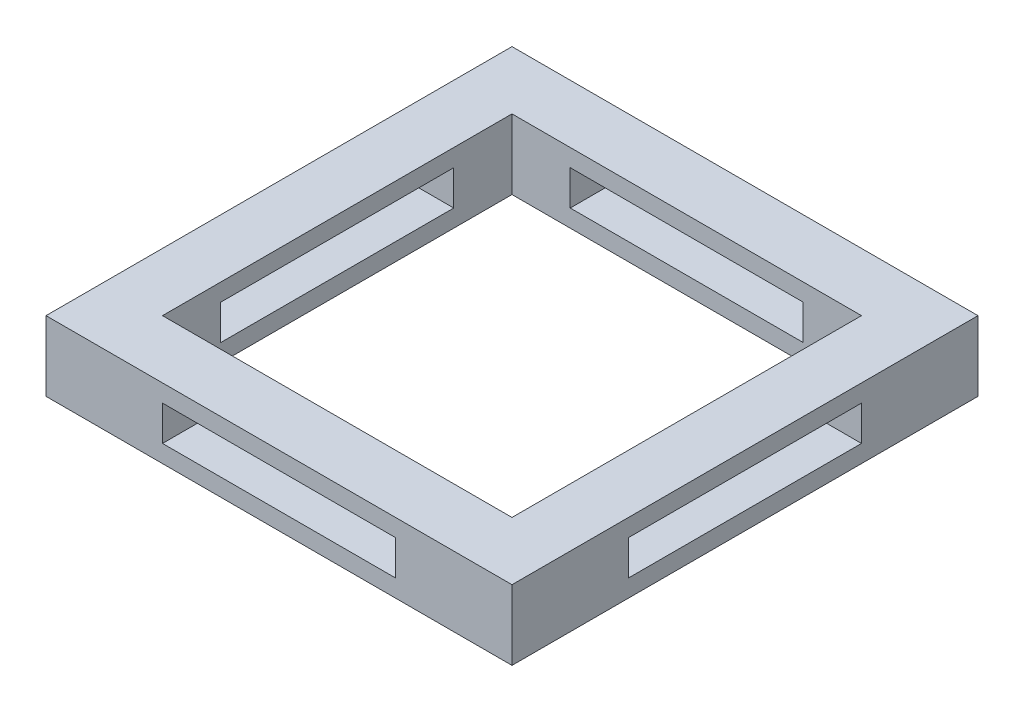
ISO-10303-21;
HEADER;
FILE_DESCRIPTION(('STEP AP214'),'2;1');
FILE_NAME('part.step','',(''),(''),'','','');
FILE_SCHEMA(('AUTOMOTIVE_DESIGN { 1 0 10303 214 1 1 1 1 }'));
ENDSEC;
DATA;
#1=APPLICATION_CONTEXT('core data for automotive mechanical design processes');
#2=APPLICATION_PROTOCOL_DEFINITION('international standard','automotive_design',2000,#1);
#3=PRODUCT_CONTEXT('',#1,'mechanical');
#4=PRODUCT('Part','Part','',(#3));
#5=PRODUCT_RELATED_PRODUCT_CATEGORY('part','',(#4));
#6=PRODUCT_DEFINITION_FORMATION('','',#4);
#7=PRODUCT_DEFINITION_CONTEXT('part definition',#1,'design');
#8=PRODUCT_DEFINITION('design','',#6,#7);
#9=PRODUCT_DEFINITION_SHAPE('','',#8);
#10=(LENGTH_UNIT() NAMED_UNIT(*) SI_UNIT(.MILLI.,.METRE.));
#11=(NAMED_UNIT(*) PLANE_ANGLE_UNIT() SI_UNIT($,.RADIAN.));
#12=(NAMED_UNIT(*) SI_UNIT($,.STERADIAN.) SOLID_ANGLE_UNIT());
#13=UNCERTAINTY_MEASURE_WITH_UNIT(LENGTH_MEASURE(1.E-05),#10,'distance_accuracy_value','');
#14=(GEOMETRIC_REPRESENTATION_CONTEXT(3) GLOBAL_UNCERTAINTY_ASSIGNED_CONTEXT((#13)) GLOBAL_UNIT_ASSIGNED_CONTEXT((#10,
#11,#12)) REPRESENTATION_CONTEXT('',''));
#15=CARTESIAN_POINT('',(0.,0.,0.));
#16=DIRECTION('',(0.,0.,1.));
#17=DIRECTION('',(1.,0.,0.));
#18=AXIS2_PLACEMENT_3D('',#15,#16,#17);
#19=CARTESIAN_POINT('',(0.,3.,0.));
#20=DIRECTION('',(0.,1.,0.));
#21=DIRECTION('',(0.,0.,1.));
#22=AXIS2_PLACEMENT_3D('',#19,#20,#21);
#23=PLANE('',#22);
#24=DIRECTION('',(0.,0.,1.));
#25=VECTOR('',#24,1.);
#26=CARTESIAN_POINT('',(-10.,3.,10.));
#27=LINE('',#26,#25);
#28=CARTESIAN_POINT('',(-10.,3.,-10.));
#29=VERTEX_POINT('',#28);
#30=CARTESIAN_POINT('',(-10.,3.,10.));
#31=VERTEX_POINT('',#30);
#32=EDGE_CURVE('E379',#29,#31,#27,.T.);
#33=ORIENTED_EDGE('',*,*,#32,.T.);
#34=DIRECTION('',(1.,0.,0.));
#35=VECTOR('',#34,1.);
#36=CARTESIAN_POINT('',(10.,3.,10.));
#37=LINE('',#36,#35);
#38=CARTESIAN_POINT('',(10.,3.,10.));
#39=VERTEX_POINT('',#38);
#40=EDGE_CURVE('E383',#31,#39,#37,.T.);
#41=ORIENTED_EDGE('',*,*,#40,.T.);
#42=DIRECTION('',(0.,0.,-1.));
#43=VECTOR('',#42,1.);
#44=CARTESIAN_POINT('',(10.,3.,10.));
#45=LINE('',#44,#43);
#46=CARTESIAN_POINT('',(10.,3.,-10.));
#47=VERTEX_POINT('',#46);
#48=EDGE_CURVE('E387',#39,#47,#45,.T.);
#49=ORIENTED_EDGE('',*,*,#48,.T.);
#50=DIRECTION('',(-1.,0.,0.));
#51=VECTOR('',#50,1.);
#52=CARTESIAN_POINT('',(10.,3.,-10.));
#53=LINE('',#52,#51);
#54=EDGE_CURVE('E390',#47,#29,#53,.T.);
#55=ORIENTED_EDGE('',*,*,#54,.T.);
#56=EDGE_LOOP('',(#33,#41,#49,#55));
#57=FACE_BOUND('',#56,.T.);
#58=DIRECTION('',(1.,0.,0.));
#59=VECTOR('',#58,1.);
#60=CARTESIAN_POINT('',(7.5,3.,7.5));
#61=LINE('',#60,#59);
#62=CARTESIAN_POINT('',(-7.5,3.,7.5));
#63=VERTEX_POINT('',#62);
#64=CARTESIAN_POINT('',(7.5,3.,7.5));
#65=VERTEX_POINT('',#64);
#66=EDGE_CURVE('E339',#63,#65,#61,.T.);
#67=ORIENTED_EDGE('',*,*,#66,.F.);
#68=DIRECTION('',(0.,0.,1.));
#69=VECTOR('',#68,1.);
#70=CARTESIAN_POINT('',(-7.5,3.,7.5));
#71=LINE('',#70,#69);
#72=CARTESIAN_POINT('',(-7.5,3.,-7.5));
#73=VERTEX_POINT('',#72);
#74=EDGE_CURVE('E336',#73,#63,#71,.T.);
#75=ORIENTED_EDGE('',*,*,#74,.F.);
#76=DIRECTION('',(-1.,0.,0.));
#77=VECTOR('',#76,1.);
#78=CARTESIAN_POINT('',(7.5,3.,-7.5));
#79=LINE('',#78,#77);
#80=CARTESIAN_POINT('',(7.5,3.,-7.5));
#81=VERTEX_POINT('',#80);
#82=EDGE_CURVE('E347',#81,#73,#79,.T.);
#83=ORIENTED_EDGE('',*,*,#82,.F.);
#84=DIRECTION('',(0.,0.,-1.));
#85=VECTOR('',#84,1.);
#86=CARTESIAN_POINT('',(7.5,3.,7.5));
#87=LINE('',#86,#85);
#88=EDGE_CURVE('E343',#65,#81,#87,.T.);
#89=ORIENTED_EDGE('',*,*,#88,.F.);
#90=EDGE_LOOP('',(#67,#75,#83,#89));
#91=FACE_BOUND('',#90,.T.);
#92=ADVANCED_FACE('F39',(#57,#91),#23,.T.);
#93=CARTESIAN_POINT('',(0.,0.,0.));
#94=DIRECTION('',(0.,1.,0.));
#95=DIRECTION('',(0.,0.,1.));
#96=AXIS2_PLACEMENT_3D('',#93,#94,#95);
#97=PLANE('',#96);
#98=DIRECTION('',(0.,0.,1.));
#99=VECTOR('',#98,1.);
#100=CARTESIAN_POINT('',(-10.,0.,10.));
#101=LINE('',#100,#99);
#102=CARTESIAN_POINT('',(-10.,0.,-10.));
#103=VERTEX_POINT('',#102);
#104=CARTESIAN_POINT('',(-10.,0.,10.));
#105=VERTEX_POINT('',#104);
#106=EDGE_CURVE('E378',#103,#105,#101,.T.);
#107=ORIENTED_EDGE('',*,*,#106,.F.);
#108=DIRECTION('',(-1.,0.,0.));
#109=VECTOR('',#108,1.);
#110=CARTESIAN_POINT('',(10.,0.,-10.));
#111=LINE('',#110,#109);
#112=CARTESIAN_POINT('',(10.,0.,-10.));
#113=VERTEX_POINT('',#112);
#114=EDGE_CURVE('E384',#113,#103,#111,.T.);
#115=ORIENTED_EDGE('',*,*,#114,.F.);
#116=DIRECTION('',(0.,0.,-1.));
#117=VECTOR('',#116,1.);
#118=CARTESIAN_POINT('',(10.,0.,10.));
#119=LINE('',#118,#117);
#120=CARTESIAN_POINT('',(10.,0.,10.));
#121=VERTEX_POINT('',#120);
#122=EDGE_CURVE('E400',#121,#113,#119,.T.);
#123=ORIENTED_EDGE('',*,*,#122,.F.);
#124=DIRECTION('',(1.,0.,0.));
#125=VECTOR('',#124,1.);
#126=CARTESIAN_POINT('',(10.,0.,10.));
#127=LINE('',#126,#125);
#128=EDGE_CURVE('E397',#105,#121,#127,.T.);
#129=ORIENTED_EDGE('',*,*,#128,.F.);
#130=EDGE_LOOP('',(#107,#115,#123,#129));
#131=FACE_BOUND('',#130,.T.);
#132=DIRECTION('',(0.,0.,1.));
#133=VECTOR('',#132,1.);
#134=CARTESIAN_POINT('',(-7.5,0.,7.5));
#135=LINE('',#134,#133);
#136=CARTESIAN_POINT('',(-7.5,0.,-7.5));
#137=VERTEX_POINT('',#136);
#138=CARTESIAN_POINT('',(-7.5,0.,7.5));
#139=VERTEX_POINT('',#138);
#140=EDGE_CURVE('E335',#137,#139,#135,.T.);
#141=ORIENTED_EDGE('',*,*,#140,.T.);
#142=DIRECTION('',(1.,0.,0.));
#143=VECTOR('',#142,1.);
#144=CARTESIAN_POINT('',(7.5,0.,7.5));
#145=LINE('',#144,#143);
#146=CARTESIAN_POINT('',(7.5,0.,7.5));
#147=VERTEX_POINT('',#146);
#148=EDGE_CURVE('E354',#139,#147,#145,.T.);
#149=ORIENTED_EDGE('',*,*,#148,.T.);
#150=DIRECTION('',(0.,0.,-1.));
#151=VECTOR('',#150,1.);
#152=CARTESIAN_POINT('',(7.5,0.,7.5));
#153=LINE('',#152,#151);
#154=CARTESIAN_POINT('',(7.5,0.,-7.5));
#155=VERTEX_POINT('',#154);
#156=EDGE_CURVE('E358',#147,#155,#153,.T.);
#157=ORIENTED_EDGE('',*,*,#156,.T.);
#158=DIRECTION('',(-1.,0.,0.));
#159=VECTOR('',#158,1.);
#160=CARTESIAN_POINT('',(7.5,0.,-7.5));
#161=LINE('',#160,#159);
#162=EDGE_CURVE('E340',#155,#137,#161,.T.);
#163=ORIENTED_EDGE('',*,*,#162,.T.);
#164=EDGE_LOOP('',(#141,#149,#157,#163));
#165=FACE_BOUND('',#164,.T.);
#166=ADVANCED_FACE('F462',(#131,#165),#97,.F.);
#167=CARTESIAN_POINT('',(-10.,3.,10.));
#168=DIRECTION('',(1.,0.,0.));
#169=DIRECTION('',(0.,0.,-1.));
#170=AXIS2_PLACEMENT_3D('',#167,#168,#169);
#171=PLANE('',#170);
#172=DIRECTION('',(0.,0.,1.));
#173=VECTOR('',#172,1.);
#174=CARTESIAN_POINT('',(-10.,0.75,5.));
#175=LINE('',#174,#173);
#176=CARTESIAN_POINT('',(-10.,0.749999999999998,-5.));
#177=VERTEX_POINT('',#176);
#178=CARTESIAN_POINT('',(-10.,0.75,5.));
#179=VERTEX_POINT('',#178);
#180=EDGE_CURVE('E241',#177,#179,#175,.T.);
#181=ORIENTED_EDGE('',*,*,#180,.F.);
#182=DIRECTION('',(0.,-1.,0.));
#183=VECTOR('',#182,1.);
#184=CARTESIAN_POINT('',(-10.,0.749999999999999,-5.));
#185=LINE('',#184,#183);
#186=CARTESIAN_POINT('',(-10.,2.25,-5.));
#187=VERTEX_POINT('',#186);
#188=EDGE_CURVE('E55',#187,#177,#185,.T.);
#189=ORIENTED_EDGE('',*,*,#188,.F.);
#190=DIRECTION('',(0.,0.,-1.));
#191=VECTOR('',#190,1.);
#192=CARTESIAN_POINT('',(-10.,2.25,5.));
#193=LINE('',#192,#191);
#194=CARTESIAN_POINT('',(-10.,2.25,5.));
#195=VERTEX_POINT('',#194);
#196=EDGE_CURVE('E228',#195,#187,#193,.T.);
#197=ORIENTED_EDGE('',*,*,#196,.F.);
#198=DIRECTION('',(0.,1.,0.));
#199=VECTOR('',#198,1.);
#200=CARTESIAN_POINT('',(-10.,0.75,5.));
#201=LINE('',#200,#199);
#202=EDGE_CURVE('E232',#179,#195,#201,.T.);
#203=ORIENTED_EDGE('',*,*,#202,.F.);
#204=EDGE_LOOP('',(#181,#189,#197,#203));
#205=FACE_BOUND('',#204,.T.);
#206=ORIENTED_EDGE('',*,*,#106,.T.);
#207=DIRECTION('',(0.,-1.,0.));
#208=VECTOR('',#207,1.);
#209=CARTESIAN_POINT('',(-10.,3.,10.));
#210=LINE('',#209,#208);
#211=EDGE_CURVE('E416',#31,#105,#210,.T.);
#212=ORIENTED_EDGE('',*,*,#211,.F.);
#213=ORIENTED_EDGE('',*,*,#32,.F.);
#214=DIRECTION('',(0.,-1.,0.));
#215=VECTOR('',#214,1.);
#216=CARTESIAN_POINT('',(-10.,3.,-10.));
#217=LINE('',#216,#215);
#218=EDGE_CURVE('E393',#29,#103,#217,.T.);
#219=ORIENTED_EDGE('',*,*,#218,.T.);
#220=EDGE_LOOP('',(#206,#212,#213,#219));
#221=FACE_BOUND('',#220,.T.);
#222=ADVANCED_FACE('F41',(#205,#221),#171,.F.);
#223=CARTESIAN_POINT('',(10.,3.,10.));
#224=DIRECTION('',(0.,0.,-1.));
#225=DIRECTION('',(-1.,0.,0.));
#226=AXIS2_PLACEMENT_3D('',#223,#224,#225);
#227=PLANE('',#226);
#228=DIRECTION('',(1.,0.,0.));
#229=VECTOR('',#228,1.);
#230=CARTESIAN_POINT('',(5.,0.750000000000001,10.));
#231=LINE('',#230,#229);
#232=CARTESIAN_POINT('',(-5.,0.749999999999999,10.));
#233=VERTEX_POINT('',#232);
#234=CARTESIAN_POINT('',(5.,0.750000000000001,10.));
#235=VERTEX_POINT('',#234);
#236=EDGE_CURVE('E293',#233,#235,#231,.T.);
#237=ORIENTED_EDGE('',*,*,#236,.F.);
#238=DIRECTION('',(0.,-1.,0.));
#239=VECTOR('',#238,1.);
#240=CARTESIAN_POINT('',(-5.,0.749999999999999,10.));
#241=LINE('',#240,#239);
#242=CARTESIAN_POINT('',(-5.,2.25,10.));
#243=VERTEX_POINT('',#242);
#244=EDGE_CURVE('E272',#243,#233,#241,.T.);
#245=ORIENTED_EDGE('',*,*,#244,.F.);
#246=DIRECTION('',(-1.,0.,0.));
#247=VECTOR('',#246,1.);
#248=CARTESIAN_POINT('',(5.,2.25,10.));
#249=LINE('',#248,#247);
#250=CARTESIAN_POINT('',(5.,2.25,10.));
#251=VERTEX_POINT('',#250);
#252=EDGE_CURVE('E278',#251,#243,#249,.T.);
#253=ORIENTED_EDGE('',*,*,#252,.F.);
#254=DIRECTION('',(0.,1.,0.));
#255=VECTOR('',#254,1.);
#256=CARTESIAN_POINT('',(5.,0.750000000000001,10.));
#257=LINE('',#256,#255);
#258=EDGE_CURVE('E297',#235,#251,#257,.T.);
#259=ORIENTED_EDGE('',*,*,#258,.F.);
#260=EDGE_LOOP('',(#237,#245,#253,#259));
#261=FACE_BOUND('',#260,.T.);
#262=ORIENTED_EDGE('',*,*,#128,.T.);
#263=DIRECTION('',(0.,-1.,0.));
#264=VECTOR('',#263,1.);
#265=CARTESIAN_POINT('',(10.,3.,10.));
#266=LINE('',#265,#264);
#267=EDGE_CURVE('E412',#39,#121,#266,.T.);
#268=ORIENTED_EDGE('',*,*,#267,.F.);
#269=ORIENTED_EDGE('',*,*,#40,.F.);
#270=ORIENTED_EDGE('',*,*,#211,.T.);
#271=EDGE_LOOP('',(#262,#268,#269,#270));
#272=FACE_BOUND('',#271,.T.);
#273=ADVANCED_FACE('F480',(#261,#272),#227,.F.);
#274=CARTESIAN_POINT('',(10.,3.,10.));
#275=DIRECTION('',(-1.,0.,0.));
#276=DIRECTION('',(0.,0.,1.));
#277=AXIS2_PLACEMENT_3D('',#274,#275,#276);
#278=PLANE('',#277);
#279=DIRECTION('',(0.,0.,-1.));
#280=VECTOR('',#279,1.);
#281=CARTESIAN_POINT('',(10.,2.25,5.));
#282=LINE('',#281,#280);
#283=CARTESIAN_POINT('',(10.,2.25,5.));
#284=VERTEX_POINT('',#283);
#285=CARTESIAN_POINT('',(10.,2.25,-5.));
#286=VERTEX_POINT('',#285);
#287=EDGE_CURVE('E226',#284,#286,#282,.T.);
#288=ORIENTED_EDGE('',*,*,#287,.T.);
#289=DIRECTION('',(0.,-1.,0.));
#290=VECTOR('',#289,1.);
#291=CARTESIAN_POINT('',(10.,0.749999999999999,-5.));
#292=LINE('',#291,#290);
#293=CARTESIAN_POINT('',(10.,0.749999999999999,-5.));
#294=VERTEX_POINT('',#293);
#295=EDGE_CURVE('E207',#286,#294,#292,.T.);
#296=ORIENTED_EDGE('',*,*,#295,.T.);
#297=DIRECTION('',(0.,0.,1.));
#298=VECTOR('',#297,1.);
#299=CARTESIAN_POINT('',(10.,0.75,5.));
#300=LINE('',#299,#298);
#301=CARTESIAN_POINT('',(10.,0.75,5.));
#302=VERTEX_POINT('',#301);
#303=EDGE_CURVE('E217',#294,#302,#300,.T.);
#304=ORIENTED_EDGE('',*,*,#303,.T.);
#305=DIRECTION('',(0.,1.,0.));
#306=VECTOR('',#305,1.);
#307=CARTESIAN_POINT('',(10.,0.75,5.));
#308=LINE('',#307,#306);
#309=EDGE_CURVE('E63',#302,#284,#308,.T.);
#310=ORIENTED_EDGE('',*,*,#309,.T.);
#311=EDGE_LOOP('',(#288,#296,#304,#310));
#312=FACE_BOUND('',#311,.T.);
#313=ORIENTED_EDGE('',*,*,#122,.T.);
#314=DIRECTION('',(0.,-1.,0.));
#315=VECTOR('',#314,1.);
#316=CARTESIAN_POINT('',(10.,3.,-10.));
#317=LINE('',#316,#315);
#318=EDGE_CURVE('E408',#47,#113,#317,.T.);
#319=ORIENTED_EDGE('',*,*,#318,.F.);
#320=ORIENTED_EDGE('',*,*,#48,.F.);
#321=ORIENTED_EDGE('',*,*,#267,.T.);
#322=EDGE_LOOP('',(#313,#319,#320,#321));
#323=FACE_BOUND('',#322,.T.);
#324=ADVANCED_FACE('F223',(#312,#323),#278,.F.);
#325=CARTESIAN_POINT('',(10.,3.,-10.));
#326=DIRECTION('',(0.,0.,1.));
#327=DIRECTION('',(1.,0.,0.));
#328=AXIS2_PLACEMENT_3D('',#325,#326,#327);
#329=PLANE('',#328);
#330=DIRECTION('',(-1.,0.,0.));
#331=VECTOR('',#330,1.);
#332=CARTESIAN_POINT('',(5.,2.25,-10.));
#333=LINE('',#332,#331);
#334=CARTESIAN_POINT('',(5.,2.25,-10.));
#335=VERTEX_POINT('',#334);
#336=CARTESIAN_POINT('',(-5.,2.25,-10.));
#337=VERTEX_POINT('',#336);
#338=EDGE_CURVE('E286',#335,#337,#333,.T.);
#339=ORIENTED_EDGE('',*,*,#338,.T.);
#340=DIRECTION('',(0.,-1.,0.));
#341=VECTOR('',#340,1.);
#342=CARTESIAN_POINT('',(-5.,0.749999999999999,-10.));
#343=LINE('',#342,#341);
#344=CARTESIAN_POINT('',(-5.,0.749999999999999,-10.));
#345=VERTEX_POINT('',#344);
#346=EDGE_CURVE('E273',#337,#345,#343,.T.);
#347=ORIENTED_EDGE('',*,*,#346,.T.);
#348=DIRECTION('',(1.,0.,0.));
#349=VECTOR('',#348,1.);
#350=CARTESIAN_POINT('',(5.,0.750000000000001,-10.));
#351=LINE('',#350,#349);
#352=CARTESIAN_POINT('',(5.,0.750000000000001,-10.));
#353=VERTEX_POINT('',#352);
#354=EDGE_CURVE('E277',#345,#353,#351,.T.);
#355=ORIENTED_EDGE('',*,*,#354,.T.);
#356=DIRECTION('',(0.,1.,0.));
#357=VECTOR('',#356,1.);
#358=CARTESIAN_POINT('',(5.,0.750000000000001,-10.));
#359=LINE('',#358,#357);
#360=EDGE_CURVE('E282',#353,#335,#359,.T.);
#361=ORIENTED_EDGE('',*,*,#360,.T.);
#362=EDGE_LOOP('',(#339,#347,#355,#361));
#363=FACE_BOUND('',#362,.T.);
#364=ORIENTED_EDGE('',*,*,#114,.T.);
#365=ORIENTED_EDGE('',*,*,#218,.F.);
#366=ORIENTED_EDGE('',*,*,#54,.F.);
#367=ORIENTED_EDGE('',*,*,#318,.T.);
#368=EDGE_LOOP('',(#364,#365,#366,#367));
#369=FACE_BOUND('',#368,.T.);
#370=ADVANCED_FACE('F475',(#363,#369),#329,.F.);
#371=CARTESIAN_POINT('',(-7.5,3.,7.5));
#372=DIRECTION('',(1.,0.,0.));
#373=DIRECTION('',(0.,0.,-1.));
#374=AXIS2_PLACEMENT_3D('',#371,#372,#373);
#375=PLANE('',#374);
#376=DIRECTION('',(0.,1.,0.));
#377=VECTOR('',#376,1.);
#378=CARTESIAN_POINT('',(-7.5,3.,-5.));
#379=LINE('',#378,#377);
#380=CARTESIAN_POINT('',(-7.5,0.749999999999999,-5.));
#381=VERTEX_POINT('',#380);
#382=CARTESIAN_POINT('',(-7.5,2.25,-5.));
#383=VERTEX_POINT('',#382);
#384=EDGE_CURVE('E269',#381,#383,#379,.T.);
#385=ORIENTED_EDGE('',*,*,#384,.F.);
#386=DIRECTION('',(0.,0.,-1.));
#387=VECTOR('',#386,1.);
#388=CARTESIAN_POINT('',(-7.5,0.75,7.5));
#389=LINE('',#388,#387);
#390=CARTESIAN_POINT('',(-7.5,0.75,5.));
#391=VERTEX_POINT('',#390);
#392=EDGE_CURVE('E251',#391,#381,#389,.T.);
#393=ORIENTED_EDGE('',*,*,#392,.F.);
#394=DIRECTION('',(0.,-1.,0.));
#395=VECTOR('',#394,1.);
#396=CARTESIAN_POINT('',(-7.5,3.,5.));
#397=LINE('',#396,#395);
#398=CARTESIAN_POINT('',(-7.5,2.25,5.));
#399=VERTEX_POINT('',#398);
#400=EDGE_CURVE('E262',#399,#391,#397,.T.);
#401=ORIENTED_EDGE('',*,*,#400,.F.);
#402=DIRECTION('',(0.,0.,1.));
#403=VECTOR('',#402,1.);
#404=CARTESIAN_POINT('',(-7.5,2.25,7.5));
#405=LINE('',#404,#403);
#406=EDGE_CURVE('E266',#383,#399,#405,.T.);
#407=ORIENTED_EDGE('',*,*,#406,.F.);
#408=EDGE_LOOP('',(#385,#393,#401,#407));
#409=FACE_BOUND('',#408,.T.);
#410=ORIENTED_EDGE('',*,*,#140,.F.);
#411=DIRECTION('',(0.,-1.,0.));
#412=VECTOR('',#411,1.);
#413=CARTESIAN_POINT('',(-7.5,3.,-7.5));
#414=LINE('',#413,#412);
#415=EDGE_CURVE('E350',#73,#137,#414,.T.);
#416=ORIENTED_EDGE('',*,*,#415,.F.);
#417=ORIENTED_EDGE('',*,*,#74,.T.);
#418=DIRECTION('',(0.,-1.,0.));
#419=VECTOR('',#418,1.);
#420=CARTESIAN_POINT('',(-7.5,3.,7.5));
#421=LINE('',#420,#419);
#422=EDGE_CURVE('E374',#63,#139,#421,.T.);
#423=ORIENTED_EDGE('',*,*,#422,.T.);
#424=EDGE_LOOP('',(#410,#416,#417,#423));
#425=FACE_BOUND('',#424,.T.);
#426=ADVANCED_FACE('F472',(#409,#425),#375,.T.);
#427=CARTESIAN_POINT('',(7.5,3.,7.5));
#428=DIRECTION('',(0.,0.,-1.));
#429=DIRECTION('',(-1.,0.,0.));
#430=AXIS2_PLACEMENT_3D('',#427,#428,#429);
#431=PLANE('',#430);
#432=DIRECTION('',(0.,1.,0.));
#433=VECTOR('',#432,1.);
#434=CARTESIAN_POINT('',(-5.,2.99999999999999,7.5));
#435=LINE('',#434,#433);
#436=CARTESIAN_POINT('',(-5.,0.749999999999999,7.5));
#437=VERTEX_POINT('',#436);
#438=CARTESIAN_POINT('',(-5.,2.25,7.5));
#439=VERTEX_POINT('',#438);
#440=EDGE_CURVE('E332',#437,#439,#435,.T.);
#441=ORIENTED_EDGE('',*,*,#440,.F.);
#442=DIRECTION('',(-1.,0.,0.));
#443=VECTOR('',#442,1.);
#444=CARTESIAN_POINT('',(7.5,0.750000000000001,7.5));
#445=LINE('',#444,#443);
#446=CARTESIAN_POINT('',(5.,0.750000000000001,7.5));
#447=VERTEX_POINT('',#446);
#448=EDGE_CURVE('E308',#447,#437,#445,.T.);
#449=ORIENTED_EDGE('',*,*,#448,.F.);
#450=DIRECTION('',(0.,-1.,0.));
#451=VECTOR('',#450,1.);
#452=CARTESIAN_POINT('',(5.,3.,7.5));
#453=LINE('',#452,#451);
#454=CARTESIAN_POINT('',(5.,2.25,7.5));
#455=VERTEX_POINT('',#454);
#456=EDGE_CURVE('E325',#455,#447,#453,.T.);
#457=ORIENTED_EDGE('',*,*,#456,.F.);
#458=DIRECTION('',(1.,0.,0.));
#459=VECTOR('',#458,1.);
#460=CARTESIAN_POINT('',(7.5,2.25,7.5));
#461=LINE('',#460,#459);
#462=EDGE_CURVE('E329',#439,#455,#461,.T.);
#463=ORIENTED_EDGE('',*,*,#462,.F.);
#464=EDGE_LOOP('',(#441,#449,#457,#463));
#465=FACE_BOUND('',#464,.T.);
#466=ORIENTED_EDGE('',*,*,#148,.F.);
#467=ORIENTED_EDGE('',*,*,#422,.F.);
#468=ORIENTED_EDGE('',*,*,#66,.T.);
#469=DIRECTION('',(0.,-1.,0.));
#470=VECTOR('',#469,1.);
#471=CARTESIAN_POINT('',(7.5,3.,7.5));
#472=LINE('',#471,#470);
#473=EDGE_CURVE('E371',#65,#147,#472,.T.);
#474=ORIENTED_EDGE('',*,*,#473,.T.);
#475=EDGE_LOOP('',(#466,#467,#468,#474));
#476=FACE_BOUND('',#475,.T.);
#477=ADVANCED_FACE('F515',(#465,#476),#431,.T.);
#478=CARTESIAN_POINT('',(7.5,3.,7.5));
#479=DIRECTION('',(-1.,0.,0.));
#480=DIRECTION('',(0.,0.,1.));
#481=AXIS2_PLACEMENT_3D('',#478,#479,#480);
#482=PLANE('',#481);
#483=DIRECTION('',(0.,-1.,0.));
#484=VECTOR('',#483,1.);
#485=CARTESIAN_POINT('',(7.5,3.,-5.));
#486=LINE('',#485,#484);
#487=CARTESIAN_POINT('',(7.5,2.25,-5.));
#488=VERTEX_POINT('',#487);
#489=CARTESIAN_POINT('',(7.5,0.749999999999999,-5.));
#490=VERTEX_POINT('',#489);
#491=EDGE_CURVE('E11',#488,#490,#486,.T.);
#492=ORIENTED_EDGE('',*,*,#491,.F.);
#493=DIRECTION('',(0.,0.,-1.));
#494=VECTOR('',#493,1.);
#495=CARTESIAN_POINT('',(7.5,2.25,7.5));
#496=LINE('',#495,#494);
#497=CARTESIAN_POINT('',(7.5,2.25,5.));
#498=VERTEX_POINT('',#497);
#499=EDGE_CURVE('E48',#498,#488,#496,.T.);
#500=ORIENTED_EDGE('',*,*,#499,.F.);
#501=DIRECTION('',(0.,1.,0.));
#502=VECTOR('',#501,1.);
#503=CARTESIAN_POINT('',(7.5,3.,5.));
#504=LINE('',#503,#502);
#505=CARTESIAN_POINT('',(7.5,0.75,5.));
#506=VERTEX_POINT('',#505);
#507=EDGE_CURVE('E436',#506,#498,#504,.T.);
#508=ORIENTED_EDGE('',*,*,#507,.F.);
#509=DIRECTION('',(0.,0.,1.));
#510=VECTOR('',#509,1.);
#511=CARTESIAN_POINT('',(7.5,0.75,7.5));
#512=LINE('',#511,#510);
#513=EDGE_CURVE('E433',#490,#506,#512,.T.);
#514=ORIENTED_EDGE('',*,*,#513,.F.);
#515=EDGE_LOOP('',(#492,#500,#508,#514));
#516=FACE_BOUND('',#515,.T.);
#517=ORIENTED_EDGE('',*,*,#156,.F.);
#518=ORIENTED_EDGE('',*,*,#473,.F.);
#519=ORIENTED_EDGE('',*,*,#88,.T.);
#520=DIRECTION('',(0.,-1.,0.));
#521=VECTOR('',#520,1.);
#522=CARTESIAN_POINT('',(7.5,3.,-7.5));
#523=LINE('',#522,#521);
#524=EDGE_CURVE('E368',#81,#155,#523,.T.);
#525=ORIENTED_EDGE('',*,*,#524,.T.);
#526=EDGE_LOOP('',(#517,#518,#519,#525));
#527=FACE_BOUND('',#526,.T.);
#528=ADVANCED_FACE('F444',(#516,#527),#482,.T.);
#529=CARTESIAN_POINT('',(7.5,3.,-7.5));
#530=DIRECTION('',(0.,0.,1.));
#531=DIRECTION('',(1.,0.,0.));
#532=AXIS2_PLACEMENT_3D('',#529,#530,#531);
#533=PLANE('',#532);
#534=DIRECTION('',(0.,-1.,0.));
#535=VECTOR('',#534,1.);
#536=CARTESIAN_POINT('',(-5.,2.99999999999999,-7.5));
#537=LINE('',#536,#535);
#538=CARTESIAN_POINT('',(-5.,2.25,-7.5));
#539=VERTEX_POINT('',#538);
#540=CARTESIAN_POINT('',(-5.,0.749999999999999,-7.5));
#541=VERTEX_POINT('',#540);
#542=EDGE_CURVE('E429',#539,#541,#537,.T.);
#543=ORIENTED_EDGE('',*,*,#542,.F.);
#544=DIRECTION('',(-1.,0.,0.));
#545=VECTOR('',#544,1.);
#546=CARTESIAN_POINT('',(7.5,2.25,-7.5));
#547=LINE('',#546,#545);
#548=CARTESIAN_POINT('',(5.,2.25,-7.5));
#549=VERTEX_POINT('',#548);
#550=EDGE_CURVE('E426',#549,#539,#547,.T.);
#551=ORIENTED_EDGE('',*,*,#550,.F.);
#552=DIRECTION('',(0.,1.,0.));
#553=VECTOR('',#552,1.);
#554=CARTESIAN_POINT('',(5.,3.,-7.5));
#555=LINE('',#554,#553);
#556=CARTESIAN_POINT('',(5.,0.750000000000001,-7.5));
#557=VERTEX_POINT('',#556);
#558=EDGE_CURVE('E423',#557,#549,#555,.T.);
#559=ORIENTED_EDGE('',*,*,#558,.F.);
#560=DIRECTION('',(1.,0.,0.));
#561=VECTOR('',#560,1.);
#562=CARTESIAN_POINT('',(7.5,0.750000000000001,-7.5));
#563=LINE('',#562,#561);
#564=EDGE_CURVE('E420',#541,#557,#563,.T.);
#565=ORIENTED_EDGE('',*,*,#564,.F.);
#566=EDGE_LOOP('',(#543,#551,#559,#565));
#567=FACE_BOUND('',#566,.T.);
#568=ORIENTED_EDGE('',*,*,#162,.F.);
#569=ORIENTED_EDGE('',*,*,#524,.F.);
#570=ORIENTED_EDGE('',*,*,#82,.T.);
#571=ORIENTED_EDGE('',*,*,#415,.T.);
#572=EDGE_LOOP('',(#568,#569,#570,#571));
#573=FACE_BOUND('',#572,.T.);
#574=ADVANCED_FACE('F510',(#567,#573),#533,.T.);
#575=CARTESIAN_POINT('',(5.,0.750000000000001,-10.));
#576=DIRECTION('',(0.,-1.,0.));
#577=DIRECTION('',(1.,0.,0.));
#578=AXIS2_PLACEMENT_3D('',#575,#576,#577);
#579=PLANE('',#578);
#580=ORIENTED_EDGE('',*,*,#564,.T.);
#581=DIRECTION('',(0.,0.,1.));
#582=VECTOR('',#581,1.);
#583=CARTESIAN_POINT('',(5.,0.750000000000001,-10.));
#584=LINE('',#583,#582);
#585=EDGE_CURVE('E315',#353,#557,#584,.T.);
#586=ORIENTED_EDGE('',*,*,#585,.F.);
#587=ORIENTED_EDGE('',*,*,#354,.F.);
#588=DIRECTION('',(0.,0.,1.));
#589=VECTOR('',#588,1.);
#590=CARTESIAN_POINT('',(-5.,0.749999999999999,-10.));
#591=LINE('',#590,#589);
#592=EDGE_CURVE('E320',#345,#541,#591,.T.);
#593=ORIENTED_EDGE('',*,*,#592,.T.);
#594=EDGE_LOOP('',(#580,#586,#587,#593));
#595=FACE_BOUND('',#594,.T.);
#596=ADVANCED_FACE('F524',(#595),#579,.F.);
#597=CARTESIAN_POINT('',(5.,0.750000000000001,-10.));
#598=DIRECTION('',(1.,0.,0.));
#599=DIRECTION('',(0.,0.,-1.));
#600=AXIS2_PLACEMENT_3D('',#597,#598,#599);
#601=PLANE('',#600);
#602=ORIENTED_EDGE('',*,*,#558,.T.);
#603=DIRECTION('',(0.,0.,1.));
#604=VECTOR('',#603,1.);
#605=CARTESIAN_POINT('',(5.,2.25,-10.));
#606=LINE('',#605,#604);
#607=EDGE_CURVE('E310',#335,#549,#606,.T.);
#608=ORIENTED_EDGE('',*,*,#607,.F.);
#609=ORIENTED_EDGE('',*,*,#360,.F.);
#610=ORIENTED_EDGE('',*,*,#585,.T.);
#611=EDGE_LOOP('',(#602,#608,#609,#610));
#612=FACE_BOUND('',#611,.T.);
#613=ADVANCED_FACE('F537',(#612),#601,.F.);
#614=CARTESIAN_POINT('',(5.,2.25,-10.));
#615=DIRECTION('',(0.,1.,0.));
#616=DIRECTION('',(-1.,0.,0.));
#617=AXIS2_PLACEMENT_3D('',#614,#615,#616);
#618=PLANE('',#617);
#619=ORIENTED_EDGE('',*,*,#550,.T.);
#620=DIRECTION('',(0.,0.,1.));
#621=VECTOR('',#620,1.);
#622=CARTESIAN_POINT('',(-5.,2.25,-10.));
#623=LINE('',#622,#621);
#624=EDGE_CURVE('E304',#337,#539,#623,.T.);
#625=ORIENTED_EDGE('',*,*,#624,.F.);
#626=ORIENTED_EDGE('',*,*,#338,.F.);
#627=ORIENTED_EDGE('',*,*,#607,.T.);
#628=EDGE_LOOP('',(#619,#625,#626,#627));
#629=FACE_BOUND('',#628,.T.);
#630=ADVANCED_FACE('F533',(#629),#618,.F.);
#631=CARTESIAN_POINT('',(-5.,0.749999999999999,-10.));
#632=DIRECTION('',(-1.,0.,0.));
#633=DIRECTION('',(0.,-1.,0.));
#634=AXIS2_PLACEMENT_3D('',#631,#632,#633);
#635=PLANE('',#634);
#636=ORIENTED_EDGE('',*,*,#542,.T.);
#637=ORIENTED_EDGE('',*,*,#592,.F.);
#638=ORIENTED_EDGE('',*,*,#346,.F.);
#639=ORIENTED_EDGE('',*,*,#624,.T.);
#640=EDGE_LOOP('',(#636,#637,#638,#639));
#641=FACE_BOUND('',#640,.T.);
#642=ADVANCED_FACE('F529',(#641),#635,.F.);
#643=ORIENTED_EDGE('',*,*,#440,.T.);
#644=EDGE_CURVE('E309',#439,#243,#623,.T.);
#645=ORIENTED_EDGE('',*,*,#644,.T.);
#646=ORIENTED_EDGE('',*,*,#244,.T.);
#647=EDGE_CURVE('E290',#437,#233,#591,.T.);
#648=ORIENTED_EDGE('',*,*,#647,.F.);
#649=EDGE_LOOP('',(#643,#645,#646,#648));
#650=FACE_BOUND('',#649,.T.);
#651=ADVANCED_FACE('F532',(#650),#635,.F.);
#652=ORIENTED_EDGE('',*,*,#462,.T.);
#653=EDGE_CURVE('E314',#455,#251,#606,.T.);
#654=ORIENTED_EDGE('',*,*,#653,.T.);
#655=ORIENTED_EDGE('',*,*,#252,.T.);
#656=ORIENTED_EDGE('',*,*,#644,.F.);
#657=EDGE_LOOP('',(#652,#654,#655,#656));
#658=FACE_BOUND('',#657,.T.);
#659=ADVANCED_FACE('F546',(#658),#618,.F.);
#660=ORIENTED_EDGE('',*,*,#456,.T.);
#661=EDGE_CURVE('E319',#447,#235,#584,.T.);
#662=ORIENTED_EDGE('',*,*,#661,.T.);
#663=ORIENTED_EDGE('',*,*,#258,.T.);
#664=ORIENTED_EDGE('',*,*,#653,.F.);
#665=EDGE_LOOP('',(#660,#662,#663,#664));
#666=FACE_BOUND('',#665,.T.);
#667=ADVANCED_FACE('F542',(#666),#601,.F.);
#668=ORIENTED_EDGE('',*,*,#448,.T.);
#669=ORIENTED_EDGE('',*,*,#647,.T.);
#670=ORIENTED_EDGE('',*,*,#236,.T.);
#671=ORIENTED_EDGE('',*,*,#661,.F.);
#672=EDGE_LOOP('',(#668,#669,#670,#671));
#673=FACE_BOUND('',#672,.T.);
#674=ADVANCED_FACE('F456',(#673),#579,.F.);
#675=CARTESIAN_POINT('',(10.,0.75,5.));
#676=DIRECTION('',(0.,-1.,0.));
#677=DIRECTION('',(0.,0.,-1.));
#678=AXIS2_PLACEMENT_3D('',#675,#676,#677);
#679=PLANE('',#678);
#680=ORIENTED_EDGE('',*,*,#513,.T.);
#681=DIRECTION('',(-1.,0.,0.));
#682=VECTOR('',#681,1.);
#683=CARTESIAN_POINT('',(10.,0.75,5.));
#684=LINE('',#683,#682);
#685=EDGE_CURVE('E219',#302,#506,#684,.T.);
#686=ORIENTED_EDGE('',*,*,#685,.F.);
#687=ORIENTED_EDGE('',*,*,#303,.F.);
#688=DIRECTION('',(-1.,0.,0.));
#689=VECTOR('',#688,1.);
#690=CARTESIAN_POINT('',(10.,0.749999999999999,-5.));
#691=LINE('',#690,#689);
#692=EDGE_CURVE('E202',#294,#490,#691,.T.);
#693=ORIENTED_EDGE('',*,*,#692,.T.);
#694=EDGE_LOOP('',(#680,#686,#687,#693));
#695=FACE_BOUND('',#694,.T.);
#696=ADVANCED_FACE('F218',(#695),#679,.F.);
#697=CARTESIAN_POINT('',(10.,0.75,5.));
#698=DIRECTION('',(0.,0.,1.));
#699=DIRECTION('',(1.,0.,0.));
#700=AXIS2_PLACEMENT_3D('',#697,#698,#699);
#701=PLANE('',#700);
#702=ORIENTED_EDGE('',*,*,#507,.T.);
#703=DIRECTION('',(-1.,0.,0.));
#704=VECTOR('',#703,1.);
#705=CARTESIAN_POINT('',(10.,2.25,5.));
#706=LINE('',#705,#704);
#707=EDGE_CURVE('E253',#284,#498,#706,.T.);
#708=ORIENTED_EDGE('',*,*,#707,.F.);
#709=ORIENTED_EDGE('',*,*,#309,.F.);
#710=ORIENTED_EDGE('',*,*,#685,.T.);
#711=EDGE_LOOP('',(#702,#708,#709,#710));
#712=FACE_BOUND('',#711,.T.);
#713=ADVANCED_FACE('F446',(#712),#701,.F.);
#714=CARTESIAN_POINT('',(10.,2.25,5.));
#715=DIRECTION('',(0.,1.,0.));
#716=DIRECTION('',(0.,0.,1.));
#717=AXIS2_PLACEMENT_3D('',#714,#715,#716);
#718=PLANE('',#717);
#719=ORIENTED_EDGE('',*,*,#499,.T.);
#720=DIRECTION('',(-1.,0.,0.));
#721=VECTOR('',#720,1.);
#722=CARTESIAN_POINT('',(10.,2.25,-5.));
#723=LINE('',#722,#721);
#724=EDGE_CURVE('E248',#286,#488,#723,.T.);
#725=ORIENTED_EDGE('',*,*,#724,.F.);
#726=ORIENTED_EDGE('',*,*,#287,.F.);
#727=ORIENTED_EDGE('',*,*,#707,.T.);
#728=EDGE_LOOP('',(#719,#725,#726,#727));
#729=FACE_BOUND('',#728,.T.);
#730=ADVANCED_FACE('F441',(#729),#718,.F.);
#731=CARTESIAN_POINT('',(10.,0.749999999999999,-5.));
#732=DIRECTION('',(0.,0.,-1.));
#733=DIRECTION('',(-1.,0.,0.));
#734=AXIS2_PLACEMENT_3D('',#731,#732,#733);
#735=PLANE('',#734);
#736=ORIENTED_EDGE('',*,*,#491,.T.);
#737=ORIENTED_EDGE('',*,*,#692,.F.);
#738=ORIENTED_EDGE('',*,*,#295,.F.);
#739=ORIENTED_EDGE('',*,*,#724,.T.);
#740=EDGE_LOOP('',(#736,#737,#738,#739));
#741=FACE_BOUND('',#740,.T.);
#742=ADVANCED_FACE('F204',(#741),#735,.F.);
#743=ORIENTED_EDGE('',*,*,#384,.T.);
#744=EDGE_CURVE('E252',#383,#187,#723,.T.);
#745=ORIENTED_EDGE('',*,*,#744,.T.);
#746=ORIENTED_EDGE('',*,*,#188,.T.);
#747=EDGE_CURVE('E214',#381,#177,#691,.T.);
#748=ORIENTED_EDGE('',*,*,#747,.F.);
#749=EDGE_LOOP('',(#743,#745,#746,#748));
#750=FACE_BOUND('',#749,.T.);
#751=ADVANCED_FACE('F548',(#750),#735,.F.);
#752=ORIENTED_EDGE('',*,*,#406,.T.);
#753=EDGE_CURVE('E257',#399,#195,#706,.T.);
#754=ORIENTED_EDGE('',*,*,#753,.T.);
#755=ORIENTED_EDGE('',*,*,#196,.T.);
#756=ORIENTED_EDGE('',*,*,#744,.F.);
#757=EDGE_LOOP('',(#752,#754,#755,#756));
#758=FACE_BOUND('',#757,.T.);
#759=ADVANCED_FACE('F455',(#758),#718,.F.);
#760=ORIENTED_EDGE('',*,*,#400,.T.);
#761=EDGE_CURVE('E213',#391,#179,#684,.T.);
#762=ORIENTED_EDGE('',*,*,#761,.T.);
#763=ORIENTED_EDGE('',*,*,#202,.T.);
#764=ORIENTED_EDGE('',*,*,#753,.F.);
#765=EDGE_LOOP('',(#760,#762,#763,#764));
#766=FACE_BOUND('',#765,.T.);
#767=ADVANCED_FACE('F449',(#766),#701,.F.);
#768=ORIENTED_EDGE('',*,*,#392,.T.);
#769=ORIENTED_EDGE('',*,*,#747,.T.);
#770=ORIENTED_EDGE('',*,*,#180,.T.);
#771=ORIENTED_EDGE('',*,*,#761,.F.);
#772=EDGE_LOOP('',(#768,#769,#770,#771));
#773=FACE_BOUND('',#772,.T.);
#774=ADVANCED_FACE('F458',(#773),#679,.F.);
#775=CLOSED_SHELL('',(#92,#166,#222,#273,#324,#370,#426,#477,#528,#574,#596,#613,#630,#642,#651,
#659,#667,#674,#696,#713,#730,#742,#751,#759,#767,#774));
#776=MANIFOLD_SOLID_BREP('B2',#775);
#777=ADVANCED_BREP_SHAPE_REPRESENTATION('',(#18,#776),#14);
#778=SHAPE_DEFINITION_REPRESENTATION(#9,#777);
ENDSEC;
END-ISO-10303-21;
